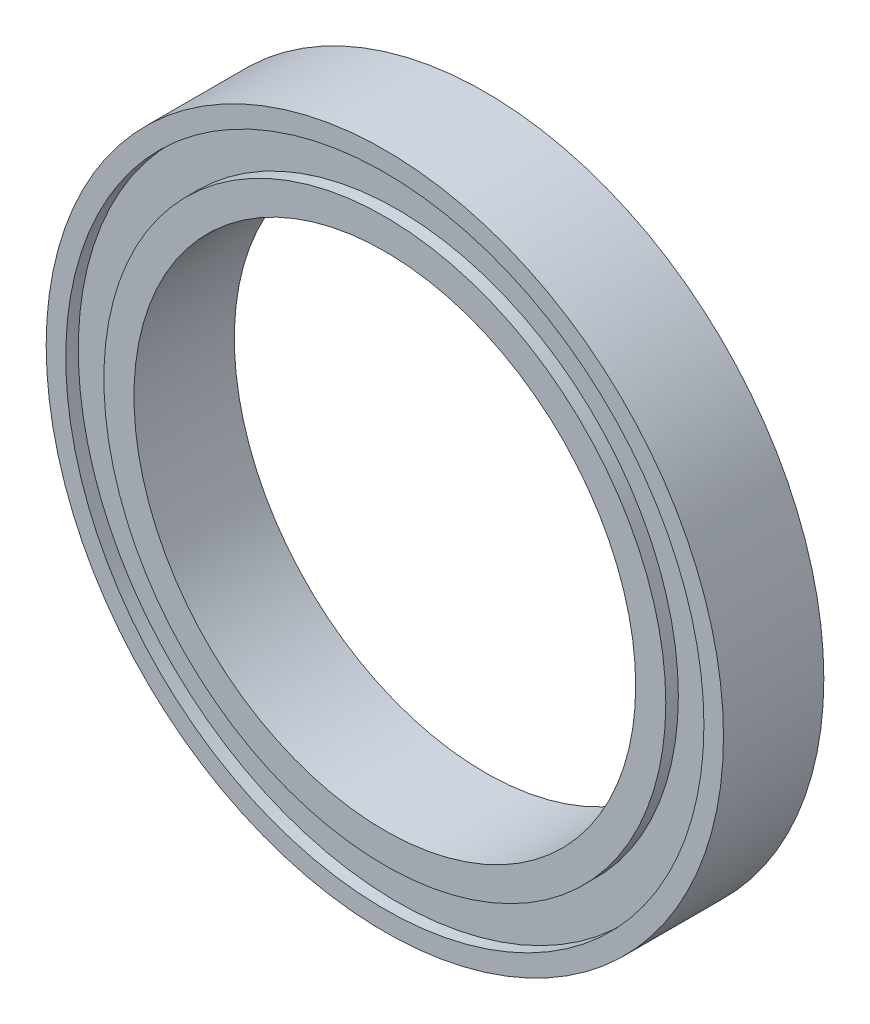
ISO-10303-21;
HEADER;
FILE_DESCRIPTION(('STEP AP214'),'2;1');
FILE_NAME('part.step','',(''),(''),'','','');
FILE_SCHEMA(('AUTOMOTIVE_DESIGN { 1 0 10303 214 1 1 1 1 }'));
ENDSEC;
DATA;
#1=APPLICATION_CONTEXT('core data for automotive mechanical design processes');
#2=APPLICATION_PROTOCOL_DEFINITION('international standard','automotive_design',2000,#1);
#3=PRODUCT_CONTEXT('',#1,'mechanical');
#4=PRODUCT('Part','Part','',(#3));
#5=PRODUCT_RELATED_PRODUCT_CATEGORY('part','',(#4));
#6=PRODUCT_DEFINITION_FORMATION('','',#4);
#7=PRODUCT_DEFINITION_CONTEXT('part definition',#1,'design');
#8=PRODUCT_DEFINITION('design','',#6,#7);
#9=PRODUCT_DEFINITION_SHAPE('','',#8);
#10=(LENGTH_UNIT() NAMED_UNIT(*) SI_UNIT(.MILLI.,.METRE.));
#11=(NAMED_UNIT(*) PLANE_ANGLE_UNIT() SI_UNIT($,.RADIAN.));
#12=(NAMED_UNIT(*) SI_UNIT($,.STERADIAN.) SOLID_ANGLE_UNIT());
#13=UNCERTAINTY_MEASURE_WITH_UNIT(LENGTH_MEASURE(1.E-05),#10,'distance_accuracy_value','');
#14=(GEOMETRIC_REPRESENTATION_CONTEXT(3) GLOBAL_UNCERTAINTY_ASSIGNED_CONTEXT((#13)) GLOBAL_UNIT_ASSIGNED_CONTEXT((#10,
#11,#12)) REPRESENTATION_CONTEXT('',''));
#15=CARTESIAN_POINT('',(0.,0.,0.));
#16=DIRECTION('',(0.,0.,1.));
#17=DIRECTION('',(1.,0.,0.));
#18=AXIS2_PLACEMENT_3D('',#15,#16,#17);
#19=CARTESIAN_POINT('',(0.,0.,0.));
#20=DIRECTION('',(0.,0.,1.));
#21=DIRECTION('',(1.,0.,0.));
#22=AXIS2_PLACEMENT_3D('',#19,#20,#21);
#23=PLANE('',#22);
#24=CARTESIAN_POINT('',(0.,0.,0.));
#25=DIRECTION('',(0.,0.,1.));
#26=DIRECTION('',(1.,0.,0.));
#27=AXIS2_PLACEMENT_3D('',#24,#25,#26);
#28=CIRCLE('',#27,10.);
#29=CARTESIAN_POINT('',(10.,0.,0.));
#30=VERTEX_POINT('',#29);
#31=EDGE_CURVE('E47',#30,#30,#28,.T.);
#32=ORIENTED_EDGE('',*,*,#31,.T.);
#33=EDGE_LOOP('',(#32));
#34=FACE_BOUND('',#33,.T.);
#35=CARTESIAN_POINT('',(0.,0.,0.));
#36=DIRECTION('',(0.,0.,-1.));
#37=DIRECTION('',(-1.,0.,0.));
#38=AXIS2_PLACEMENT_3D('',#35,#36,#37);
#39=CIRCLE('',#38,11.2);
#40=CARTESIAN_POINT('',(-11.2,0.,0.));
#41=VERTEX_POINT('',#40);
#42=EDGE_CURVE('E71',#41,#41,#39,.T.);
#43=ORIENTED_EDGE('',*,*,#42,.T.);
#44=EDGE_LOOP('',(#43));
#45=FACE_BOUND('',#44,.T.);
#46=ADVANCED_FACE('F34',(#34,#45),#23,.F.);
#47=CARTESIAN_POINT('',(0.,0.,4.));
#48=DIRECTION('',(0.,0.,1.));
#49=DIRECTION('',(1.,0.,0.));
#50=AXIS2_PLACEMENT_3D('',#47,#48,#49);
#51=PLANE('',#50);
#52=CARTESIAN_POINT('',(0.,0.,4.));
#53=DIRECTION('',(0.,0.,1.));
#54=DIRECTION('',(1.,0.,0.));
#55=AXIS2_PLACEMENT_3D('',#52,#53,#54);
#56=CIRCLE('',#55,10.);
#57=CARTESIAN_POINT('',(10.,0.,4.));
#58=VERTEX_POINT('',#57);
#59=EDGE_CURVE('E45',#58,#58,#56,.T.);
#60=ORIENTED_EDGE('',*,*,#59,.F.);
#61=EDGE_LOOP('',(#60));
#62=FACE_BOUND('',#61,.T.);
#63=CARTESIAN_POINT('',(0.,0.,4.));
#64=DIRECTION('',(0.,0.,1.));
#65=DIRECTION('',(1.,0.,0.));
#66=AXIS2_PLACEMENT_3D('',#63,#64,#65);
#67=CIRCLE('',#66,11.2);
#68=CARTESIAN_POINT('',(11.2,0.,4.));
#69=VERTEX_POINT('',#68);
#70=EDGE_CURVE('E59',#69,#69,#67,.T.);
#71=ORIENTED_EDGE('',*,*,#70,.T.);
#72=EDGE_LOOP('',(#71));
#73=FACE_BOUND('',#72,.T.);
#74=ADVANCED_FACE('F109',(#62,#73),#51,.T.);
#75=CARTESIAN_POINT('',(0.,0.,4.));
#76=DIRECTION('',(0.,0.,1.));
#77=DIRECTION('',(1.,0.,0.));
#78=AXIS2_PLACEMENT_3D('',#75,#76,#77);
#79=CIRCLE('',#78,12.72);
#80=CARTESIAN_POINT('',(12.72,0.,4.));
#81=VERTEX_POINT('',#80);
#82=EDGE_CURVE('E53',#81,#81,#79,.T.);
#83=ORIENTED_EDGE('',*,*,#82,.F.);
#84=EDGE_LOOP('',(#83));
#85=FACE_BOUND('',#84,.T.);
#86=CARTESIAN_POINT('',(0.,0.,4.));
#87=DIRECTION('',(0.,0.,1.));
#88=DIRECTION('',(1.,0.,0.));
#89=AXIS2_PLACEMENT_3D('',#86,#87,#88);
#90=CIRCLE('',#89,13.5);
#91=CARTESIAN_POINT('',(13.5,0.,4.));
#92=VERTEX_POINT('',#91);
#93=EDGE_CURVE('E10',#92,#92,#90,.T.);
#94=ORIENTED_EDGE('',*,*,#93,.T.);
#95=EDGE_LOOP('',(#94));
#96=FACE_BOUND('',#95,.T.);
#97=ADVANCED_FACE('F96',(#85,#96),#51,.T.);
#98=CARTESIAN_POINT('',(0.,0.,0.));
#99=DIRECTION('',(0.,0.,-1.));
#100=DIRECTION('',(-1.,0.,0.));
#101=AXIS2_PLACEMENT_3D('',#98,#99,#100);
#102=CIRCLE('',#101,12.72);
#103=CARTESIAN_POINT('',(-12.72,0.,0.));
#104=VERTEX_POINT('',#103);
#105=EDGE_CURVE('E65',#104,#104,#102,.T.);
#106=ORIENTED_EDGE('',*,*,#105,.F.);
#107=EDGE_LOOP('',(#106));
#108=FACE_BOUND('',#107,.T.);
#109=CARTESIAN_POINT('',(0.,0.,0.));
#110=DIRECTION('',(0.,0.,1.));
#111=DIRECTION('',(1.,0.,0.));
#112=AXIS2_PLACEMENT_3D('',#109,#110,#111);
#113=CIRCLE('',#112,13.5);
#114=CARTESIAN_POINT('',(13.5,0.,0.));
#115=VERTEX_POINT('',#114);
#116=EDGE_CURVE('E38',#115,#115,#113,.T.);
#117=ORIENTED_EDGE('',*,*,#116,.F.);
#118=EDGE_LOOP('',(#117));
#119=FACE_BOUND('',#118,.T.);
#120=ADVANCED_FACE('F93',(#108,#119),#23,.F.);
#121=CARTESIAN_POINT('',(0.,0.,4.));
#122=DIRECTION('',(0.,0.,-1.));
#123=DIRECTION('',(-1.,0.,0.));
#124=AXIS2_PLACEMENT_3D('',#121,#122,#123);
#125=CYLINDRICAL_SURFACE('',#124,13.5);
#126=ORIENTED_EDGE('',*,*,#93,.F.);
#127=EDGE_LOOP('',(#126));
#128=FACE_BOUND('',#127,.T.);
#129=ORIENTED_EDGE('',*,*,#116,.T.);
#130=EDGE_LOOP('',(#129));
#131=FACE_BOUND('',#130,.T.);
#132=ADVANCED_FACE('F36',(#128,#131),#125,.T.);
#133=CARTESIAN_POINT('',(0.,0.,4.));
#134=DIRECTION('',(0.,0.,-1.));
#135=DIRECTION('',(-1.,0.,0.));
#136=AXIS2_PLACEMENT_3D('',#133,#134,#135);
#137=CYLINDRICAL_SURFACE('',#136,10.);
#138=ORIENTED_EDGE('',*,*,#59,.T.);
#139=EDGE_LOOP('',(#138));
#140=FACE_BOUND('',#139,.T.);
#141=ORIENTED_EDGE('',*,*,#31,.F.);
#142=EDGE_LOOP('',(#141));
#143=FACE_BOUND('',#142,.T.);
#144=ADVANCED_FACE('F100',(#140,#143),#137,.F.);
#145=CARTESIAN_POINT('',(0.,0.,3.5));
#146=DIRECTION('',(0.,0.,1.));
#147=DIRECTION('',(1.,0.,0.));
#148=AXIS2_PLACEMENT_3D('',#145,#146,#147);
#149=CYLINDRICAL_SURFACE('',#148,12.72);
#150=CARTESIAN_POINT('',(0.,0.,3.5));
#151=DIRECTION('',(0.,0.,1.));
#152=DIRECTION('',(1.,0.,0.));
#153=AXIS2_PLACEMENT_3D('',#150,#151,#152);
#154=CIRCLE('',#153,12.72);
#155=CARTESIAN_POINT('',(12.72,0.,3.5));
#156=VERTEX_POINT('',#155);
#157=EDGE_CURVE('E50',#156,#156,#154,.T.);
#158=ORIENTED_EDGE('',*,*,#157,.F.);
#159=EDGE_LOOP('',(#158));
#160=FACE_BOUND('',#159,.T.);
#161=ORIENTED_EDGE('',*,*,#82,.T.);
#162=EDGE_LOOP('',(#161));
#163=FACE_BOUND('',#162,.T.);
#164=ADVANCED_FACE('F105',(#160,#163),#149,.F.);
#165=CARTESIAN_POINT('',(0.,0.,3.5));
#166=DIRECTION('',(0.,0.,1.));
#167=DIRECTION('',(1.,0.,0.));
#168=AXIS2_PLACEMENT_3D('',#165,#166,#167);
#169=PLANE('',#168);
#170=CARTESIAN_POINT('',(0.,0.,3.5));
#171=DIRECTION('',(0.,0.,1.));
#172=DIRECTION('',(1.,0.,0.));
#173=AXIS2_PLACEMENT_3D('',#170,#171,#172);
#174=CIRCLE('',#173,11.2);
#175=CARTESIAN_POINT('',(11.2,0.,3.5));
#176=VERTEX_POINT('',#175);
#177=EDGE_CURVE('E56',#176,#176,#174,.T.);
#178=ORIENTED_EDGE('',*,*,#177,.F.);
#179=EDGE_LOOP('',(#178));
#180=FACE_BOUND('',#179,.T.);
#181=ORIENTED_EDGE('',*,*,#157,.T.);
#182=EDGE_LOOP('',(#181));
#183=FACE_BOUND('',#182,.T.);
#184=ADVANCED_FACE('F122',(#180,#183),#169,.T.);
#185=CARTESIAN_POINT('',(0.,0.,3.5));
#186=DIRECTION('',(0.,0.,1.));
#187=DIRECTION('',(1.,0.,0.));
#188=AXIS2_PLACEMENT_3D('',#185,#186,#187);
#189=CYLINDRICAL_SURFACE('',#188,11.2);
#190=ORIENTED_EDGE('',*,*,#177,.T.);
#191=EDGE_LOOP('',(#190));
#192=FACE_BOUND('',#191,.T.);
#193=ORIENTED_EDGE('',*,*,#70,.F.);
#194=EDGE_LOOP('',(#193));
#195=FACE_BOUND('',#194,.T.);
#196=ADVANCED_FACE('F89',(#192,#195),#189,.T.);
#197=CARTESIAN_POINT('',(0.,0.,0.5));
#198=DIRECTION('',(0.,0.,-1.));
#199=DIRECTION('',(-1.,0.,0.));
#200=AXIS2_PLACEMENT_3D('',#197,#198,#199);
#201=CYLINDRICAL_SURFACE('',#200,12.72);
#202=CARTESIAN_POINT('',(0.,0.,0.5));
#203=DIRECTION('',(0.,0.,-1.));
#204=DIRECTION('',(-1.,0.,0.));
#205=AXIS2_PLACEMENT_3D('',#202,#203,#204);
#206=CIRCLE('',#205,12.72);
#207=CARTESIAN_POINT('',(-12.72,0.,0.5));
#208=VERTEX_POINT('',#207);
#209=EDGE_CURVE('E62',#208,#208,#206,.T.);
#210=ORIENTED_EDGE('',*,*,#209,.F.);
#211=EDGE_LOOP('',(#210));
#212=FACE_BOUND('',#211,.T.);
#213=ORIENTED_EDGE('',*,*,#105,.T.);
#214=EDGE_LOOP('',(#213));
#215=FACE_BOUND('',#214,.T.);
#216=ADVANCED_FACE('F83',(#212,#215),#201,.F.);
#217=CARTESIAN_POINT('',(0.,0.,0.5));
#218=DIRECTION('',(0.,0.,-1.));
#219=DIRECTION('',(-1.,0.,0.));
#220=AXIS2_PLACEMENT_3D('',#217,#218,#219);
#221=PLANE('',#220);
#222=CARTESIAN_POINT('',(0.,0.,0.5));
#223=DIRECTION('',(0.,0.,-1.));
#224=DIRECTION('',(-1.,0.,0.));
#225=AXIS2_PLACEMENT_3D('',#222,#223,#224);
#226=CIRCLE('',#225,11.2);
#227=CARTESIAN_POINT('',(-11.2,0.,0.5));
#228=VERTEX_POINT('',#227);
#229=EDGE_CURVE('E68',#228,#228,#226,.T.);
#230=ORIENTED_EDGE('',*,*,#229,.F.);
#231=EDGE_LOOP('',(#230));
#232=FACE_BOUND('',#231,.T.);
#233=ORIENTED_EDGE('',*,*,#209,.T.);
#234=EDGE_LOOP('',(#233));
#235=FACE_BOUND('',#234,.T.);
#236=ADVANCED_FACE('F80',(#232,#235),#221,.T.);
#237=CARTESIAN_POINT('',(0.,0.,0.5));
#238=DIRECTION('',(0.,0.,-1.));
#239=DIRECTION('',(-1.,0.,0.));
#240=AXIS2_PLACEMENT_3D('',#237,#238,#239);
#241=CYLINDRICAL_SURFACE('',#240,11.2);
#242=ORIENTED_EDGE('',*,*,#229,.T.);
#243=EDGE_LOOP('',(#242));
#244=FACE_BOUND('',#243,.T.);
#245=ORIENTED_EDGE('',*,*,#42,.F.);
#246=EDGE_LOOP('',(#245));
#247=FACE_BOUND('',#246,.T.);
#248=ADVANCED_FACE('F77',(#244,#247),#241,.T.);
#249=CLOSED_SHELL('',(#46,#74,#97,#120,#132,#144,#164,#184,#196,#216,#236,#248));
#250=MANIFOLD_SOLID_BREP('B2',#249);
#251=ADVANCED_BREP_SHAPE_REPRESENTATION('',(#18,#250),#14);
#252=SHAPE_DEFINITION_REPRESENTATION(#9,#251);
ENDSEC;
END-ISO-10303-21;
